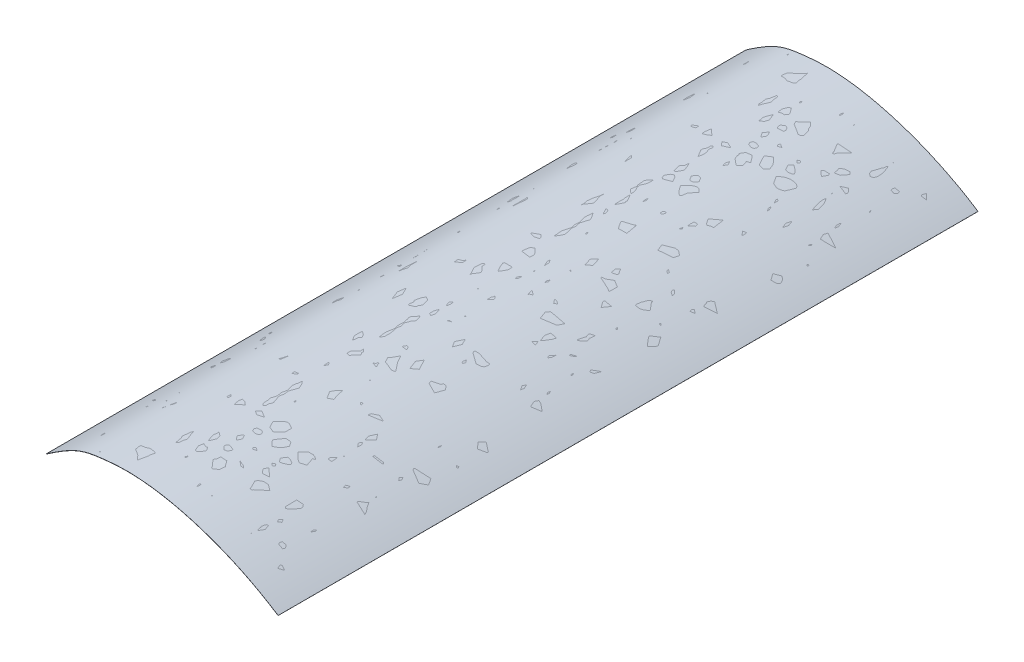
ISO-10303-21;
HEADER;
FILE_DESCRIPTION(('STEP AP214'),'2;1');
FILE_NAME('part.step','',(''),(''),'','','');
FILE_SCHEMA(('AUTOMOTIVE_DESIGN { 1 0 10303 214 1 1 1 1 }'));
ENDSEC;
DATA;
#1=APPLICATION_CONTEXT('core data for automotive mechanical design processes');
#2=APPLICATION_PROTOCOL_DEFINITION('international standard','automotive_design',2000,#1);
#3=PRODUCT_CONTEXT('',#1,'mechanical');
#4=PRODUCT('Part','Part','',(#3));
#5=PRODUCT_RELATED_PRODUCT_CATEGORY('part','',(#4));
#6=PRODUCT_DEFINITION_FORMATION('','',#4);
#7=PRODUCT_DEFINITION_CONTEXT('part definition',#1,'design');
#8=PRODUCT_DEFINITION('design','',#6,#7);
#9=PRODUCT_DEFINITION_SHAPE('','',#8);
#10=(LENGTH_UNIT() NAMED_UNIT(*) SI_UNIT(.MILLI.,.METRE.));
#11=(NAMED_UNIT(*) PLANE_ANGLE_UNIT() SI_UNIT($,.RADIAN.));
#12=(NAMED_UNIT(*) SI_UNIT($,.STERADIAN.) SOLID_ANGLE_UNIT());
#13=UNCERTAINTY_MEASURE_WITH_UNIT(LENGTH_MEASURE(1.E-05),#10,'distance_accuracy_value','');
#14=(GEOMETRIC_REPRESENTATION_CONTEXT(3) GLOBAL_UNCERTAINTY_ASSIGNED_CONTEXT((#13)) GLOBAL_UNIT_ASSIGNED_CONTEXT((#10,
#11,#12)) REPRESENTATION_CONTEXT('',''));
#15=CARTESIAN_POINT('',(0.,0.,0.));
#16=DIRECTION('',(0.,0.,1.));
#17=DIRECTION('',(1.,0.,0.));
#18=AXIS2_PLACEMENT_3D('',#15,#16,#17);
#19=CARTESIAN_POINT('',(-1743.60796018333,593.830470177674,600.2));
#20=CARTESIAN_POINT('',(-1719.50790421299,610.537812827558,600.2));
#21=CARTESIAN_POINT('',(-1709.38954114274,613.399774738822,600.2));
#22=CARTESIAN_POINT('',(-1646.2802897382,619.241808081418,600.2));
#23=CARTESIAN_POINT('',(-1585.71664888805,600.423930322916,600.2));
#24=CARTESIAN_POINT('',(-1544.64995665936,573.441433080316,600.2));
#25=B_SPLINE_CURVE_WITH_KNOTS('',3,(#19,#20,#21,#22,#23,#24),.UNSPECIFIED.,.F.,.F.,(4,1,1,4),
(0.,0.320554642089293,0.420554642089293,1.),.UNSPECIFIED.);
#26=DIRECTION('',(0.,0.,-1.));
#27=VECTOR('',#26,1.);
#28=SURFACE_OF_LINEAR_EXTRUSION('',#25,#27);
#29=CARTESIAN_POINT('',(-1743.60796018333,593.830470177674,0.));
#30=CARTESIAN_POINT('',(-1719.50790421299,610.537812827558,0.));
#31=CARTESIAN_POINT('',(-1709.38954114274,613.399774738822,0.));
#32=CARTESIAN_POINT('',(-1646.2802897382,619.241808081418,0.));
#33=CARTESIAN_POINT('',(-1585.71664888805,600.423930322916,0.));
#34=CARTESIAN_POINT('',(-1544.64995665936,573.441433080316,0.));
#35=B_SPLINE_CURVE_WITH_KNOTS('',3,(#29,#30,#31,#32,#33,#34),.UNSPECIFIED.,.F.,.F.,(4,1,1,4),
(0.,0.320554642089293,0.420554642089293,1.),.UNSPECIFIED.);
#36=CARTESIAN_POINT('',(-1743.60796018333,593.830470177674,0.));
#37=VERTEX_POINT('',#36);
#38=CARTESIAN_POINT('',(-1544.64995665936,573.441433080316,0.));
#39=VERTEX_POINT('',#38);
#40=EDGE_CURVE('E111',#37,#39,#35,.T.);
#41=ORIENTED_EDGE('',*,*,#40,.T.);
#42=DIRECTION('',(0.,0.,-1.));
#43=VECTOR('',#42,1.);
#44=CARTESIAN_POINT('',(-1544.64995665936,573.441433080316,600.2));
#45=LINE('',#44,#43);
#46=CARTESIAN_POINT('',(-1544.64995665936,573.441433080316,600.2));
#47=VERTEX_POINT('',#46);
#48=EDGE_CURVE('E11',#47,#39,#45,.T.);
#49=ORIENTED_EDGE('',*,*,#48,.F.);
#50=CARTESIAN_POINT('',(-1743.60796018333,593.830470177674,600.2));
#51=VERTEX_POINT('',#50);
#52=EDGE_CURVE('E80',#51,#47,#25,.T.);
#53=ORIENTED_EDGE('',*,*,#52,.F.);
#54=DIRECTION('',(0.,0.,-1.));
#55=VECTOR('',#54,1.);
#56=CARTESIAN_POINT('',(-1743.60796018333,593.830470177674,600.2));
#57=LINE('',#56,#55);
#58=EDGE_CURVE('E88',#51,#37,#57,.T.);
#59=ORIENTED_EDGE('',*,*,#58,.T.);
#60=EDGE_LOOP('',(#41,#49,#53,#59));
#61=FACE_BOUND('',#60,.T.);
#62=ADVANCED_FACE('F28',(#61),#28,.F.);
#63=CARTESIAN_POINT('',(-1544.59504482077,573.525007538035,600.2));
#64=DIRECTION('',(-0.835744577188081,0.549118385870232,0.));
#65=DIRECTION('',(-0.549118385870232,-0.835744577188081,0.));
#66=AXIS2_PLACEMENT_3D('',#63,#64,#65);
#67=PLANE('',#66);
#68=DIRECTION('',(0.549118385870232,0.835744577188081,0.));
#69=VECTOR('',#68,1.);
#70=CARTESIAN_POINT('',(-1544.59504482077,573.525007538035,0.));
#71=LINE('',#70,#69);
#72=CARTESIAN_POINT('',(-1544.59504482077,573.525007538035,0.));
#73=VERTEX_POINT('',#72);
#74=EDGE_CURVE('E84',#39,#73,#71,.T.);
#75=ORIENTED_EDGE('',*,*,#74,.T.);
#76=DIRECTION('',(0.,0.,-1.));
#77=VECTOR('',#76,1.);
#78=CARTESIAN_POINT('',(-1544.59504482077,573.525007538035,600.2));
#79=LINE('',#78,#77);
#80=CARTESIAN_POINT('',(-1544.59504482077,573.525007538035,600.2));
#81=VERTEX_POINT('',#80);
#82=EDGE_CURVE('E37',#81,#73,#79,.T.);
#83=ORIENTED_EDGE('',*,*,#82,.F.);
#84=DIRECTION('',(0.549118385870232,0.835744577188081,0.));
#85=VECTOR('',#84,1.);
#86=CARTESIAN_POINT('',(-1544.59504482077,573.525007538035,600.2));
#87=LINE('',#86,#85);
#88=EDGE_CURVE('E75',#47,#81,#87,.T.);
#89=ORIENTED_EDGE('',*,*,#88,.F.);
#90=ORIENTED_EDGE('',*,*,#48,.T.);
#91=EDGE_LOOP('',(#75,#83,#89,#90));
#92=FACE_BOUND('',#91,.T.);
#93=ADVANCED_FACE('F83',(#92),#67,.F.);
#94=CARTESIAN_POINT('',(-1544.59504482077,573.525007538035,600.2));
#95=CARTESIAN_POINT('',(-1546.81690899379,574.984863218349,600.2));
#96=CARTESIAN_POINT('',(-1551.30082351731,577.826880634051,600.2));
#97=CARTESIAN_POINT('',(-1560.50780627902,583.26393119726,600.2));
#98=CARTESIAN_POINT('',(-1572.3601607968,589.551302581426,600.2));
#99=CARTESIAN_POINT('',(-1586.97193086048,596.24974021751,600.2));
#100=CARTESIAN_POINT('',(-1601.79207451817,602.056621702993,600.2));
#101=CARTESIAN_POINT('',(-1616.64523619041,606.930368390384,600.2));
#102=CARTESIAN_POINT('',(-1631.35503083111,610.82799800416,600.2));
#103=CARTESIAN_POINT('',(-1645.74413871939,613.708396810608,600.2));
#104=CARTESIAN_POINT('',(-1659.64024215442,615.52416438994,600.2));
#105=CARTESIAN_POINT('',(-1672.85228319774,616.250864323373,600.2));
#106=CARTESIAN_POINT('',(-1683.19172877777,615.856790836363,600.2));
#107=CARTESIAN_POINT('',(-1690.74433014987,615.188792173272,600.2));
#108=CARTESIAN_POINT('',(-1697.6490023376,614.432584074125,600.2));
#109=CARTESIAN_POINT('',(-1704.9855404485,613.422395735622,600.2));
#110=CARTESIAN_POINT('',(-1711.61041450141,611.760075967973,600.2));
#111=CARTESIAN_POINT('',(-1717.04707161642,609.72721892651,600.2));
#112=CARTESIAN_POINT('',(-1721.3377436816,607.771125399941,600.2));
#113=CARTESIAN_POINT('',(-1725.98508360296,605.304700101953,600.2));
#114=CARTESIAN_POINT('',(-1730.27500614705,602.758210898565,600.2));
#115=CARTESIAN_POINT('',(-1734.03005642449,600.386186825926,600.2));
#116=CARTESIAN_POINT('',(-1737.02422233583,598.431013990982,600.2));
#117=CARTESIAN_POINT('',(-1739.68849100742,596.642564429737,600.2));
#118=CARTESIAN_POINT('',(-1741.9172035275,595.120504527914,600.2));
#119=CARTESIAN_POINT('',(-1743.08794279743,594.312651449658,600.2));
#120=CARTESIAN_POINT('',(-1743.6649334715,593.912653171259,600.2));
#121=B_SPLINE_CURVE_WITH_KNOTS('',3,(#94,#95,#96,#97,#98,#99,#100,#101,#102,#103,#104,#105,#106,
#107,#108,#109,#110,#111,#112,#113,#114,#115,#116,#117,#118,#119,#120),.UNSPECIFIED.,.F.,.F.,(4,
1,1,1,1,1,1,1,1,1,1,1,1,1,1,1,1,1,1,1,1,1,1,1,4),(0.,0.03125,0.0625,0.125,0.1875,0.25,0.3125,
0.375,0.4375,0.5,0.5625,0.625,0.65625,0.6875,0.75,0.8125,0.84375,0.875,0.90625,0.9375,0.953125,
0.96875,0.984375,0.9921875,1.),.UNSPECIFIED.);
#122=DIRECTION('',(0.,0.,-1.));
#123=VECTOR('',#122,1.);
#124=SURFACE_OF_LINEAR_EXTRUSION('',#121,#123);
#125=CARTESIAN_POINT('',(-1544.59504482077,573.525007538035,0.));
#126=CARTESIAN_POINT('',(-1546.81690899379,574.984863218349,0.));
#127=CARTESIAN_POINT('',(-1551.30082351731,577.826880634051,0.));
#128=CARTESIAN_POINT('',(-1560.50780627902,583.26393119726,0.));
#129=CARTESIAN_POINT('',(-1572.3601607968,589.551302581426,0.));
#130=CARTESIAN_POINT('',(-1586.97193086048,596.24974021751,0.));
#131=CARTESIAN_POINT('',(-1601.79207451817,602.056621702993,0.));
#132=CARTESIAN_POINT('',(-1616.64523619041,606.930368390384,0.));
#133=CARTESIAN_POINT('',(-1631.35503083111,610.82799800416,0.));
#134=CARTESIAN_POINT('',(-1645.74413871939,613.708396810608,0.));
#135=CARTESIAN_POINT('',(-1659.64024215442,615.52416438994,0.));
#136=CARTESIAN_POINT('',(-1672.85228319774,616.250864323373,0.));
#137=CARTESIAN_POINT('',(-1683.19172877777,615.856790836363,0.));
#138=CARTESIAN_POINT('',(-1690.74433014987,615.188792173272,0.));
#139=CARTESIAN_POINT('',(-1697.6490023376,614.432584074125,0.));
#140=CARTESIAN_POINT('',(-1704.9855404485,613.422395735622,0.));
#141=CARTESIAN_POINT('',(-1711.61041450141,611.760075967973,0.));
#142=CARTESIAN_POINT('',(-1717.04707161642,609.72721892651,0.));
#143=CARTESIAN_POINT('',(-1721.3377436816,607.771125399941,0.));
#144=CARTESIAN_POINT('',(-1725.98508360296,605.304700101953,0.));
#145=CARTESIAN_POINT('',(-1730.27500614705,602.758210898565,0.));
#146=CARTESIAN_POINT('',(-1734.03005642449,600.386186825926,0.));
#147=CARTESIAN_POINT('',(-1737.02422233583,598.431013990982,0.));
#148=CARTESIAN_POINT('',(-1739.68849100742,596.642564429737,0.));
#149=CARTESIAN_POINT('',(-1741.9172035275,595.120504527914,0.));
#150=CARTESIAN_POINT('',(-1743.08794279743,594.312651449658,0.));
#151=CARTESIAN_POINT('',(-1743.6649334715,593.912653171259,0.));
#152=B_SPLINE_CURVE_WITH_KNOTS('',3,(#125,#126,#127,#128,#129,#130,#131,#132,#133,#134,#135,
#136,#137,#138,#139,#140,#141,#142,#143,#144,#145,#146,#147,#148,#149,#150,#151),.UNSPECIFIED.,
.F.,.F.,(4,1,1,1,1,1,1,1,1,1,1,1,1,1,1,1,1,1,1,1,1,1,1,1,4),(0.,0.03125,0.0625,0.125,0.1875,
0.25,0.3125,0.375,0.4375,0.5,0.5625,0.625,0.65625,0.6875,0.75,0.8125,0.84375,0.875,0.90625,
0.9375,0.953125,0.96875,0.984375,0.9921875,1.),.UNSPECIFIED.);
#153=CARTESIAN_POINT('',(-1743.6649334715,593.912653171259,0.));
#154=VERTEX_POINT('',#153);
#155=EDGE_CURVE('E62',#73,#154,#152,.T.);
#156=ORIENTED_EDGE('',*,*,#155,.T.);
#157=DIRECTION('',(0.,0.,-1.));
#158=VECTOR('',#157,1.);
#159=CARTESIAN_POINT('',(-1743.6649334715,593.912653171259,600.2));
#160=LINE('',#159,#158);
#161=CARTESIAN_POINT('',(-1743.6649334715,593.912653171259,600.2));
#162=VERTEX_POINT('',#161);
#163=EDGE_CURVE('E85',#162,#154,#160,.T.);
#164=ORIENTED_EDGE('',*,*,#163,.F.);
#165=EDGE_CURVE('E78',#81,#162,#121,.T.);
#166=ORIENTED_EDGE('',*,*,#165,.F.);
#167=ORIENTED_EDGE('',*,*,#82,.T.);
#168=EDGE_LOOP('',(#156,#164,#166,#167));
#169=FACE_BOUND('',#168,.T.);
#170=ADVANCED_FACE('F86',(#169),#124,.F.);
#171=CARTESIAN_POINT('',(-1743.6649334715,593.912653171259,600.2));
#172=DIRECTION('',(0.821829935850435,0.569732881743788,0.));
#173=DIRECTION('',(-0.569732881743788,0.821829935850435,0.));
#174=AXIS2_PLACEMENT_3D('',#171,#172,#173);
#175=PLANE('',#174);
#176=DIRECTION('',(0.569732881743788,-0.821829935850435,0.));
#177=VECTOR('',#176,1.);
#178=CARTESIAN_POINT('',(-1743.6649334715,593.912653171259,0.));
#179=LINE('',#178,#177);
#180=EDGE_CURVE('E68',#154,#37,#179,.T.);
#181=ORIENTED_EDGE('',*,*,#180,.T.);
#182=ORIENTED_EDGE('',*,*,#58,.F.);
#183=DIRECTION('',(0.569732881743788,-0.821829935850435,0.));
#184=VECTOR('',#183,1.);
#185=CARTESIAN_POINT('',(-1743.6649334715,593.912653171259,600.2));
#186=LINE('',#185,#184);
#187=EDGE_CURVE('E45',#162,#51,#186,.T.);
#188=ORIENTED_EDGE('',*,*,#187,.F.);
#189=ORIENTED_EDGE('',*,*,#163,.T.);
#190=EDGE_LOOP('',(#181,#182,#188,#189));
#191=FACE_BOUND('',#190,.T.);
#192=ADVANCED_FACE('F100',(#191),#175,.F.);
#193=CARTESIAN_POINT('',(-1659.53553734203,615.243087026691,600.2));
#194=DIRECTION('',(0.,0.,1.));
#195=DIRECTION('',(1.00000000000001,0.,0.));
#196=AXIS2_PLACEMENT_3D('',#193,#194,#195);
#197=PLANE('',#196);
#198=ORIENTED_EDGE('',*,*,#52,.T.);
#199=ORIENTED_EDGE('',*,*,#88,.T.);
#200=ORIENTED_EDGE('',*,*,#165,.T.);
#201=ORIENTED_EDGE('',*,*,#187,.T.);
#202=EDGE_LOOP('',(#198,#199,#200,#201));
#203=FACE_BOUND('',#202,.T.);
#204=ADVANCED_FACE('F76',(#203),#197,.T.);
#205=CARTESIAN_POINT('',(-1659.53553734203,615.243087026691,0.));
#206=DIRECTION('',(0.,0.,1.));
#207=DIRECTION('',(1.00000000000001,0.,0.));
#208=AXIS2_PLACEMENT_3D('',#205,#206,#207);
#209=PLANE('',#208);
#210=ORIENTED_EDGE('',*,*,#40,.F.);
#211=ORIENTED_EDGE('',*,*,#180,.F.);
#212=ORIENTED_EDGE('',*,*,#155,.F.);
#213=ORIENTED_EDGE('',*,*,#74,.F.);
#214=EDGE_LOOP('',(#210,#211,#212,#213));
#215=FACE_BOUND('',#214,.T.);
#216=ADVANCED_FACE('F128',(#215),#209,.F.);
#217=CLOSED_SHELL('',(#62,#93,#170,#192,#204,#216));
#218=MANIFOLD_SOLID_BREP('B2',#217);
#219=ADVANCED_BREP_SHAPE_REPRESENTATION('',(#18,#218),#14);
#220=SHAPE_DEFINITION_REPRESENTATION(#9,#219);
ENDSEC;
END-ISO-10303-21;
